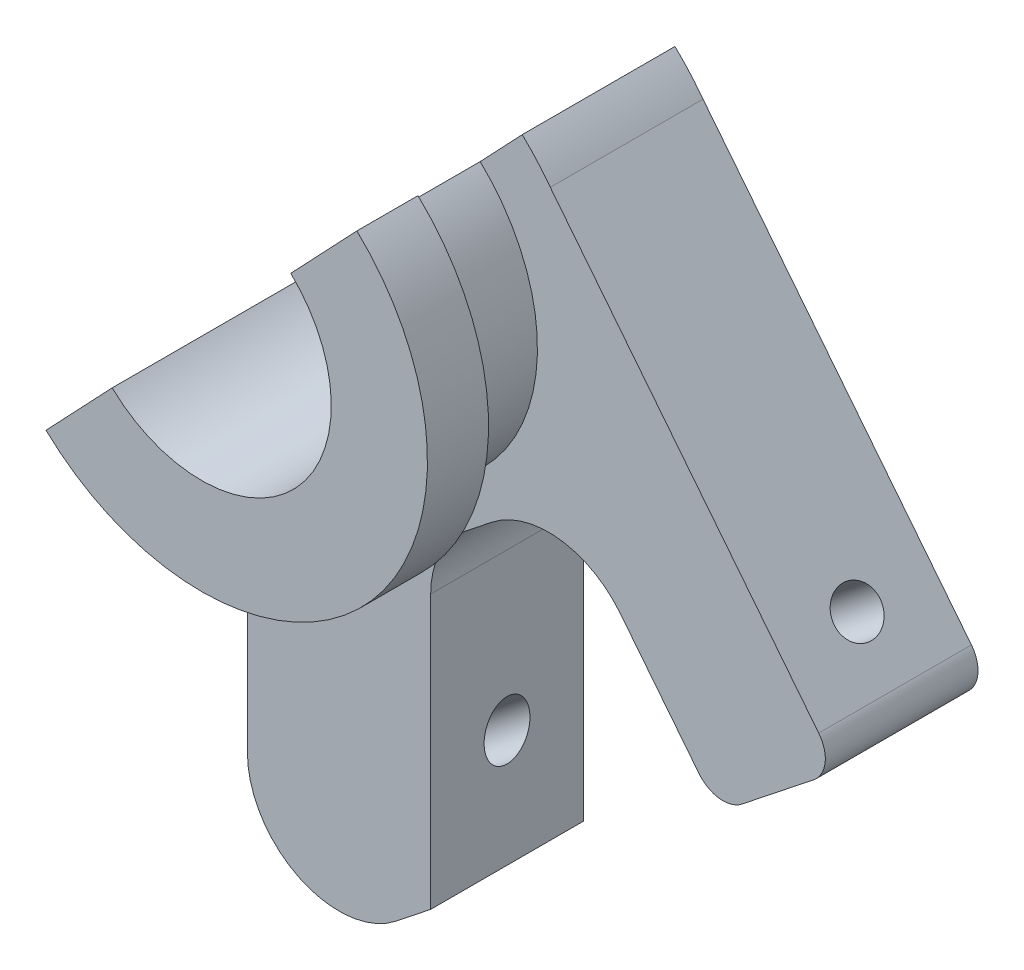
ISO-10303-21;
HEADER;
FILE_DESCRIPTION(('STEP AP214'),'2;1');
FILE_NAME('part.step','',(''),(''),'','','');
FILE_SCHEMA(('AUTOMOTIVE_DESIGN { 1 0 10303 214 1 1 1 1 }'));
ENDSEC;
DATA;
#1=APPLICATION_CONTEXT('core data for automotive mechanical design processes');
#2=APPLICATION_PROTOCOL_DEFINITION('international standard','automotive_design',2000,#1);
#3=PRODUCT_CONTEXT('',#1,'mechanical');
#4=PRODUCT('Part','Part','',(#3));
#5=PRODUCT_RELATED_PRODUCT_CATEGORY('part','',(#4));
#6=PRODUCT_DEFINITION_FORMATION('','',#4);
#7=PRODUCT_DEFINITION_CONTEXT('part definition',#1,'design');
#8=PRODUCT_DEFINITION('design','',#6,#7);
#9=PRODUCT_DEFINITION_SHAPE('','',#8);
#10=(LENGTH_UNIT() NAMED_UNIT(*) SI_UNIT(.MILLI.,.METRE.));
#11=(NAMED_UNIT(*) PLANE_ANGLE_UNIT() SI_UNIT($,.RADIAN.));
#12=(NAMED_UNIT(*) SI_UNIT($,.STERADIAN.) SOLID_ANGLE_UNIT());
#13=UNCERTAINTY_MEASURE_WITH_UNIT(LENGTH_MEASURE(1.E-05),#10,'distance_accuracy_value','');
#14=(GEOMETRIC_REPRESENTATION_CONTEXT(3) GLOBAL_UNCERTAINTY_ASSIGNED_CONTEXT((#13)) GLOBAL_UNIT_ASSIGNED_CONTEXT((#10,
#11,#12)) REPRESENTATION_CONTEXT('',''));
#15=CARTESIAN_POINT('',(0.,0.,0.));
#16=DIRECTION('',(0.,0.,1.));
#17=DIRECTION('',(1.,0.,0.));
#18=AXIS2_PLACEMENT_3D('',#15,#16,#17);
#19=CARTESIAN_POINT('',(9.56432153161784,-12.0602154080419,5.));
#20=DIRECTION('',(-0.621367715122971,0.783519088856716,0.));
#21=DIRECTION('',(-0.783519088856716,-0.621367715122971,0.));
#22=AXIS2_PLACEMENT_3D('',#19,#20,#21);
#23=PLANE('',#22);
#24=DIRECTION('',(0.,0.,1.));
#25=VECTOR('',#24,1.);
#26=CARTESIAN_POINT('',(1.36853143114638,-18.5598647985735,-17.));
#27=LINE('',#26,#25);
#28=CARTESIAN_POINT('',(1.36853143114638,-18.5598647985735,0.));
#29=VERTEX_POINT('',#28);
#30=CARTESIAN_POINT('',(1.36853143114638,-18.5598647985735,5.));
#31=VERTEX_POINT('',#30);
#32=EDGE_CURVE('E195',#29,#31,#27,.T.);
#33=ORIENTED_EDGE('',*,*,#32,.F.);
#34=DIRECTION('',(0.783519088856716,0.621367715122971,0.));
#35=VECTOR('',#34,1.);
#36=CARTESIAN_POINT('',(9.56432153161784,-12.0602154080419,0.));
#37=LINE('',#36,#35);
#38=CARTESIAN_POINT('',(2.50442828577747,-17.6590448399847,0.));
#39=VERTEX_POINT('',#38);
#40=EDGE_CURVE('E255',#29,#39,#37,.T.);
#41=ORIENTED_EDGE('',*,*,#40,.T.);
#42=DIRECTION('',(0.,0.,-1.));
#43=VECTOR('',#42,1.);
#44=CARTESIAN_POINT('',(2.50442828577747,-17.6590448399847,5.));
#45=LINE('',#44,#43);
#46=CARTESIAN_POINT('',(2.50442828577747,-17.6590448399847,5.));
#47=VERTEX_POINT('',#46);
#48=EDGE_CURVE('E280',#47,#39,#45,.T.);
#49=ORIENTED_EDGE('',*,*,#48,.F.);
#50=DIRECTION('',(0.783519088856716,0.621367715122971,0.));
#51=VECTOR('',#50,1.);
#52=CARTESIAN_POINT('',(9.56432153161784,-12.0602154080419,5.));
#53=LINE('',#52,#51);
#54=EDGE_CURVE('E223',#31,#47,#53,.T.);
#55=ORIENTED_EDGE('',*,*,#54,.F.);
#56=EDGE_LOOP('',(#33,#41,#49,#55));
#57=FACE_BOUND('',#56,.T.);
#58=ADVANCED_FACE('F47',(#57),#23,.F.);
#59=CARTESIAN_POINT('',(0.,0.,5.));
#60=DIRECTION('',(0.,0.,1.));
#61=DIRECTION('',(1.,0.,0.));
#62=AXIS2_PLACEMENT_3D('',#59,#60,#61);
#63=PLANE('',#62);
#64=CARTESIAN_POINT('',(12.6953065918597,-9.57719609091795,5.));
#65=VERTEX_POINT('',#64);
#66=CARTESIAN_POINT('',(15.0458638584298,-7.71309294554904,5.));
#67=VERTEX_POINT('',#66);
#68=EDGE_CURVE('E234',#65,#67,#53,.T.);
#69=ORIENTED_EDGE('',*,*,#68,.T.);
#70=CARTESIAN_POINT('',(14.4244961433068,-6.92957385669232,5.));
#71=DIRECTION('',(0.,0.,1.));
#72=DIRECTION('',(1.,0.,0.));
#73=AXIS2_PLACEMENT_3D('',#70,#71,#72);
#74=CIRCLE('',#73,1.);
#75=CARTESIAN_POINT('',(15.2080152321636,-6.30820614156935,5.));
#76=VERTEX_POINT('',#75);
#77=EDGE_CURVE('E56',#67,#76,#74,.T.);
#78=ORIENTED_EDGE('',*,*,#77,.T.);
#79=DIRECTION('',(-0.621367715122971,0.783519088856716,0.));
#80=VECTOR('',#79,1.);
#81=CARTESIAN_POINT('',(6.2650614156687,4.96849017761589,5.));
#82=LINE('',#81,#80);
#83=CARTESIAN_POINT('',(6.42116057758665,4.77165556561317,5.));
#84=VERTEX_POINT('',#83);
#85=EDGE_CURVE('E245',#76,#84,#82,.T.);
#86=ORIENTED_EDGE('',*,*,#85,.T.);
#87=CARTESIAN_POINT('',(0.,0.,5.));
#88=DIRECTION('',(0.,0.,1.));
#89=DIRECTION('',(1.,0.,0.));
#90=AXIS2_PLACEMENT_3D('',#87,#88,#89);
#91=CIRCLE('',#90,8.);
#92=CARTESIAN_POINT('',(5.50251468024793,5.80709326545183,5.));
#93=VERTEX_POINT('',#92);
#94=EDGE_CURVE('E248',#84,#93,#91,.T.);
#95=ORIENTED_EDGE('',*,*,#94,.T.);
#96=DIRECTION('',(0.687814335030992,0.725886658181479,0.));
#97=VECTOR('',#96,1.);
#98=CARTESIAN_POINT('',(0.,0.,5.));
#99=LINE('',#98,#97);
#100=CARTESIAN_POINT('',(4.12688601018595,4.35531994908887,5.));
#101=VERTEX_POINT('',#100);
#102=EDGE_CURVE('E389',#101,#93,#99,.T.);
#103=ORIENTED_EDGE('',*,*,#102,.F.);
#104=CARTESIAN_POINT('',(0.,0.,5.));
#105=DIRECTION('',(0.,0.,1.));
#106=DIRECTION('',(1.,0.,0.));
#107=AXIS2_PLACEMENT_3D('',#104,#105,#106);
#108=CIRCLE('',#107,6.);
#109=CARTESIAN_POINT('',(-3.49557171422254,-4.87657445249504,5.));
#110=VERTEX_POINT('',#109);
#111=EDGE_CURVE('E216',#110,#101,#108,.T.);
#112=ORIENTED_EDGE('',*,*,#111,.F.);
#113=DIRECTION('',(0.,-1.,0.));
#114=VECTOR('',#113,1.);
#115=CARTESIAN_POINT('',(-3.49557171422254,0.,5.));
#116=LINE('',#115,#114);
#117=CARTESIAN_POINT('',(-3.49557171422253,-16.2093075320034,5.));
#118=VERTEX_POINT('',#117);
#119=EDGE_CURVE('E206',#110,#118,#116,.T.);
#120=ORIENTED_EDGE('',*,*,#119,.T.);
#121=CARTESIAN_POINT('',(-0.495571714222533,-16.2093075320034,5.));
#122=DIRECTION('',(0.,0.,1.));
#123=DIRECTION('',(1.,0.,0.));
#124=AXIS2_PLACEMENT_3D('',#121,#122,#123);
#125=CIRCLE('',#124,3.);
#126=EDGE_CURVE('E189',#118,#31,#125,.T.);
#127=ORIENTED_EDGE('',*,*,#126,.T.);
#128=ORIENTED_EDGE('',*,*,#54,.T.);
#129=DIRECTION('',(0.,1.,0.));
#130=VECTOR('',#129,1.);
#131=CARTESIAN_POINT('',(2.50442828577747,0.,5.));
#132=LINE('',#131,#130);
#133=CARTESIAN_POINT('',(2.50442828577747,-8.71673207473975,5.));
#134=VERTEX_POINT('',#133);
#135=EDGE_CURVE('E233',#47,#134,#132,.T.);
#136=ORIENTED_EDGE('',*,*,#135,.T.);
#137=CARTESIAN_POINT('',(5.50442828577747,-8.71673207473975,5.));
#138=DIRECTION('',(0.,0.,1.));
#139=DIRECTION('',(1.,0.,0.));
#140=AXIS2_PLACEMENT_3D('',#137,#138,#139);
#141=CIRCLE('',#140,3.);
#142=CARTESIAN_POINT('',(3.64032514040855,-6.36617480816961,5.));
#143=VERTEX_POINT('',#142);
#144=EDGE_CURVE('E633',#134,#143,#141,.F.);
#145=ORIENTED_EDGE('',*,*,#144,.T.);
#146=DIRECTION('',(0.783519088856716,0.621367715122971,0.));
#147=VECTOR('',#146,1.);
#148=CARTESIAN_POINT('',(4.50491593464154,-5.68051339421119,5.));
#149=LINE('',#148,#147);
#150=CARTESIAN_POINT('',(4.50182463945651,-5.68296493757907,5.));
#151=VERTEX_POINT('',#150);
#152=EDGE_CURVE('E238',#143,#151,#149,.T.);
#153=ORIENTED_EDGE('',*,*,#152,.T.);
#154=CARTESIAN_POINT('',(6.36592778482542,-8.03352220414922,5.));
#155=DIRECTION('',(0.,0.,1.));
#156=DIRECTION('',(1.,0.,0.));
#157=AXIS2_PLACEMENT_3D('',#154,#155,#156);
#158=CIRCLE('',#157,3.);
#159=CARTESIAN_POINT('',(8.71648505139557,-6.16941905878031,5.));
#160=VERTEX_POINT('',#159);
#161=EDGE_CURVE('E375',#151,#160,#158,.F.);
#162=ORIENTED_EDGE('',*,*,#161,.T.);
#163=DIRECTION('',(0.62136771512297,-0.783519088856717,0.));
#164=VECTOR('',#163,1.);
#165=CARTESIAN_POINT('',(2.34746597138513,1.86165160200104,5.));
#166=LINE('',#165,#164);
#167=CARTESIAN_POINT('',(11.29041978788,-9.4150447171842,5.));
#168=VERTEX_POINT('',#167);
#169=EDGE_CURVE('E242',#160,#168,#166,.T.);
#170=ORIENTED_EDGE('',*,*,#169,.T.);
#171=CARTESIAN_POINT('',(12.0739388767367,-8.79367700206124,5.));
#172=DIRECTION('',(0.,0.,1.));
#173=DIRECTION('',(1.,0.,0.));
#174=AXIS2_PLACEMENT_3D('',#171,#172,#173);
#175=CIRCLE('',#174,1.);
#176=EDGE_CURVE('E359',#168,#65,#175,.T.);
#177=ORIENTED_EDGE('',*,*,#176,.T.);
#178=EDGE_LOOP('',(#69,#78,#86,#95,#103,#112,#120,#127,#128,#136,#145,#153,#162,#170,#177));
#179=FACE_BOUND('',#178,.T.);
#180=ADVANCED_FACE('F213',(#179),#63,.T.);
#181=CARTESIAN_POINT('',(0.,0.,0.));
#182=DIRECTION('',(0.,0.,1.));
#183=DIRECTION('',(1.,0.,0.));
#184=AXIS2_PLACEMENT_3D('',#181,#182,#183);
#185=PLANE('',#184);
#186=DIRECTION('',(-0.621367715122971,0.783519088856716,0.));
#187=VECTOR('',#186,1.);
#188=CARTESIAN_POINT('',(6.2650614156687,4.96849017761589,0.));
#189=LINE('',#188,#187);
#190=CARTESIAN_POINT('',(15.2080152321636,-6.30820614156935,0.));
#191=VERTEX_POINT('',#190);
#192=CARTESIAN_POINT('',(6.42116057758665,4.77165556561317,0.));
#193=VERTEX_POINT('',#192);
#194=EDGE_CURVE('E271',#191,#193,#189,.T.);
#195=ORIENTED_EDGE('',*,*,#194,.F.);
#196=CARTESIAN_POINT('',(14.4244961433068,-6.92957385669232,0.));
#197=DIRECTION('',(0.,0.,1.));
#198=DIRECTION('',(1.,0.,0.));
#199=AXIS2_PLACEMENT_3D('',#196,#197,#198);
#200=CIRCLE('',#199,1.);
#201=CARTESIAN_POINT('',(15.0458638584298,-7.71309294554904,0.));
#202=VERTEX_POINT('',#201);
#203=EDGE_CURVE('E356',#191,#202,#200,.F.);
#204=ORIENTED_EDGE('',*,*,#203,.T.);
#205=CARTESIAN_POINT('',(12.6953065918597,-9.57719609091795,0.));
#206=VERTEX_POINT('',#205);
#207=EDGE_CURVE('E260',#206,#202,#37,.T.);
#208=ORIENTED_EDGE('',*,*,#207,.F.);
#209=CARTESIAN_POINT('',(12.0739388767367,-8.79367700206124,0.));
#210=DIRECTION('',(0.,0.,1.));
#211=DIRECTION('',(1.,0.,0.));
#212=AXIS2_PLACEMENT_3D('',#209,#210,#211);
#213=CIRCLE('',#212,1.);
#214=CARTESIAN_POINT('',(11.29041978788,-9.4150447171842,0.));
#215=VERTEX_POINT('',#214);
#216=EDGE_CURVE('E374',#206,#215,#213,.F.);
#217=ORIENTED_EDGE('',*,*,#216,.T.);
#218=DIRECTION('',(0.62136771512297,-0.783519088856717,0.));
#219=VECTOR('',#218,1.);
#220=CARTESIAN_POINT('',(2.34746597138513,1.86165160200104,0.));
#221=LINE('',#220,#219);
#222=CARTESIAN_POINT('',(8.71648505139557,-6.16941905878031,0.));
#223=VERTEX_POINT('',#222);
#224=EDGE_CURVE('E268',#223,#215,#221,.T.);
#225=ORIENTED_EDGE('',*,*,#224,.F.);
#226=CARTESIAN_POINT('',(6.36592778482542,-8.03352220414922,0.));
#227=DIRECTION('',(0.,0.,1.));
#228=DIRECTION('',(1.,0.,0.));
#229=AXIS2_PLACEMENT_3D('',#226,#227,#228);
#230=CIRCLE('',#229,3.);
#231=CARTESIAN_POINT('',(4.50182463945651,-5.68296493757907,0.));
#232=VERTEX_POINT('',#231);
#233=EDGE_CURVE('E380',#223,#232,#230,.T.);
#234=ORIENTED_EDGE('',*,*,#233,.T.);
#235=DIRECTION('',(0.783519088856716,0.621367715122971,0.));
#236=VECTOR('',#235,1.);
#237=CARTESIAN_POINT('',(4.50491593464154,-5.68051339421119,0.));
#238=LINE('',#237,#236);
#239=CARTESIAN_POINT('',(3.64032514040855,-6.36617480816961,0.));
#240=VERTEX_POINT('',#239);
#241=EDGE_CURVE('E264',#240,#232,#238,.T.);
#242=ORIENTED_EDGE('',*,*,#241,.F.);
#243=CARTESIAN_POINT('',(5.50442828577747,-8.71673207473975,0.));
#244=DIRECTION('',(0.,0.,1.));
#245=DIRECTION('',(1.,0.,0.));
#246=AXIS2_PLACEMENT_3D('',#243,#244,#245);
#247=CIRCLE('',#246,3.);
#248=CARTESIAN_POINT('',(2.50442828577747,-8.71673207473975,0.));
#249=VERTEX_POINT('',#248);
#250=EDGE_CURVE('E628',#240,#249,#247,.T.);
#251=ORIENTED_EDGE('',*,*,#250,.T.);
#252=DIRECTION('',(0.,1.,0.));
#253=VECTOR('',#252,1.);
#254=CARTESIAN_POINT('',(2.50442828577747,0.,0.));
#255=LINE('',#254,#253);
#256=EDGE_CURVE('E259',#39,#249,#255,.T.);
#257=ORIENTED_EDGE('',*,*,#256,.F.);
#258=ORIENTED_EDGE('',*,*,#40,.F.);
#259=CARTESIAN_POINT('',(-0.495571714222533,-16.2093075320034,0.));
#260=DIRECTION('',(0.,0.,1.));
#261=DIRECTION('',(1.,0.,0.));
#262=AXIS2_PLACEMENT_3D('',#259,#260,#261);
#263=CIRCLE('',#262,3.);
#264=CARTESIAN_POINT('',(-3.49557171422253,-16.2093075320034,0.));
#265=VERTEX_POINT('',#264);
#266=EDGE_CURVE('E302',#265,#29,#263,.T.);
#267=ORIENTED_EDGE('',*,*,#266,.F.);
#268=DIRECTION('',(0.,-1.,0.));
#269=VECTOR('',#268,1.);
#270=CARTESIAN_POINT('',(-3.49557171422254,0.,0.));
#271=LINE('',#270,#269);
#272=CARTESIAN_POINT('',(-3.49557171422254,-3.68906075497302,0.));
#273=VERTEX_POINT('',#272);
#274=EDGE_CURVE('E209',#273,#265,#271,.T.);
#275=ORIENTED_EDGE('',*,*,#274,.F.);
#276=DIRECTION('',(0.687814335030992,0.725886658181479,0.));
#277=VECTOR('',#276,1.);
#278=CARTESIAN_POINT('',(0.,0.,0.));
#279=LINE('',#278,#277);
#280=CARTESIAN_POINT('',(-2.92321092388172,-3.08501829727128,0.));
#281=VERTEX_POINT('',#280);
#282=EDGE_CURVE('E425',#273,#281,#279,.T.);
#283=ORIENTED_EDGE('',*,*,#282,.T.);
#284=CARTESIAN_POINT('',(0.,0.,0.));
#285=DIRECTION('',(0.,0.,1.));
#286=DIRECTION('',(1.,0.,0.));
#287=AXIS2_PLACEMENT_3D('',#284,#285,#286);
#288=CIRCLE('',#287,4.25);
#289=CARTESIAN_POINT('',(2.92321092388171,3.08501829727129,0.));
#290=VERTEX_POINT('',#289);
#291=EDGE_CURVE('E219',#281,#290,#288,.T.);
#292=ORIENTED_EDGE('',*,*,#291,.T.);
#293=CARTESIAN_POINT('',(5.50251468024793,5.80709326545183,0.));
#294=VERTEX_POINT('',#293);
#295=EDGE_CURVE('E440',#290,#294,#279,.T.);
#296=ORIENTED_EDGE('',*,*,#295,.T.);
#297=CARTESIAN_POINT('',(0.,0.,0.));
#298=DIRECTION('',(0.,0.,1.));
#299=DIRECTION('',(1.,0.,0.));
#300=AXIS2_PLACEMENT_3D('',#297,#298,#299);
#301=CIRCLE('',#300,8.);
#302=EDGE_CURVE('E225',#193,#294,#301,.T.);
#303=ORIENTED_EDGE('',*,*,#302,.F.);
#304=EDGE_LOOP('',(#195,#204,#208,#217,#225,#234,#242,#251,#257,#258,#267,#275,#283,#292,#296,#303));
#305=FACE_BOUND('',#304,.T.);
#306=ADVANCED_FACE('F331',(#305),#185,.F.);
#307=CARTESIAN_POINT('',(-3.27214015293013,-18.4112576965613,2.5));
#308=DIRECTION('',(0.783519088856716,0.621367715122971,0.));
#309=DIRECTION('',(-0.621367715122971,0.783519088856716,0.));
#310=AXIS2_PLACEMENT_3D('',#307,#308,#309);
#311=CYLINDRICAL_SURFACE('',#310,0.750000000000001);
#312=CARTESIAN_POINT('',(2.50442828577747,-13.830165566121,2.5));
#313=DIRECTION('',(-1.,0.,0.));
#314=DIRECTION('',(0.,1.,0.));
#315=AXIS2_PLACEMENT_3D('',#312,#313,#314);
#316=ELLIPSE('',#315,0.95721981846591,0.750000000000001);
#317=CARTESIAN_POINT('',(2.50442828577747,-12.8729457476551,2.5));
#318=VERTEX_POINT('',#317);
#319=EDGE_CURVE('E455',#318,#318,#316,.T.);
#320=ORIENTED_EDGE('',*,*,#319,.F.);
#321=EDGE_LOOP('',(#320));
#322=FACE_BOUND('',#321,.T.);
#323=CARTESIAN_POINT('',(-3.23751478749802,-17.4265783247675,2.5));
#324=CARTESIAN_POINT('',(-3.237514676094,-17.4265797378768,2.54141522526759));
#325=CARTESIAN_POINT('',(-3.2360775314301,-17.429831674764,2.58284346957352));
#326=CARTESIAN_POINT('',(-3.2303161821381,-17.4426852474565,2.66451027342446));
#327=CARTESIAN_POINT('',(-3.22599029724954,-17.4522905787372,2.70474812633497));
#328=CARTESIAN_POINT('',(-3.21442687573413,-17.4773831586244,2.78284106146588));
#329=CARTESIAN_POINT('',(-3.20719309735771,-17.4928628136354,2.82069914661832));
#330=CARTESIAN_POINT('',(-3.18977226097577,-17.5290365726179,2.89309325575936));
#331=CARTESIAN_POINT('',(-3.1795850775856,-17.5497308979695,2.92762913862336));
#332=CARTESIAN_POINT('',(-3.15598938811252,-17.5959809884086,2.99315849357938));
#333=CARTESIAN_POINT('',(-3.14252097523027,-17.6216250668095,3.02406808010521));
#334=CARTESIAN_POINT('',(-3.11247821412046,-17.6765424847334,3.08072841830791));
#335=CARTESIAN_POINT('',(-3.09590357579974,-17.7058161631415,3.10647868768647));
#336=CARTESIAN_POINT('',(-3.05948695615394,-17.7673941347249,3.15243264028944));
#337=CARTESIAN_POINT('',(-3.03960261140391,-17.7997350157085,3.17255391644845));
#338=CARTESIAN_POINT('',(-2.99698286871107,-17.865957889117,3.20614289324591));
#339=CARTESIAN_POINT('',(-2.97424789204308,-17.8998396533551,3.21961157557465));
#340=CARTESIAN_POINT('',(-2.92685772118447,-17.9672927845899,3.23924435037358));
#341=CARTESIAN_POINT('',(-2.90225075749436,-18.0008565347669,3.24555089329798));
#342=CARTESIAN_POINT('',(-2.85135014773914,-18.067278878835,3.25112751378267));
#343=CARTESIAN_POINT('',(-2.82505675161594,-18.1001375762611,3.25039863166288));
#344=CARTESIAN_POINT('',(-2.77217498192739,-18.1634679064605,3.24202754492496));
#345=CARTESIAN_POINT('',(-2.74560609997254,-18.1939763282562,3.23453910248384));
#346=CARTESIAN_POINT('',(-2.69247283563422,-18.2526363270415,3.21310861898545));
#347=CARTESIAN_POINT('',(-2.66590845356557,-18.2807877784759,3.19916623438678));
#348=CARTESIAN_POINT('',(-2.61345936297497,-18.3343891802991,3.16509922879388));
#349=CARTESIAN_POINT('',(-2.58758296433925,-18.3598124230585,3.14491988660148));
#350=CARTESIAN_POINT('',(-2.53770087421153,-18.4072371949508,3.09899329626512));
#351=CARTESIAN_POINT('',(-2.51369550916984,-18.4292381276368,3.07324507943182));
#352=CARTESIAN_POINT('',(-2.46786297032497,-18.4700675605303,3.01608737740529));
#353=CARTESIAN_POINT('',(-2.44611233241719,-18.4887940842642,2.98454353229567));
#354=CARTESIAN_POINT('',(-2.40649866668964,-18.5221045295058,2.91712000793793));
#355=CARTESIAN_POINT('',(-2.38863582057862,-18.536688257396,2.8812401261527));
#356=CARTESIAN_POINT('',(-2.35757253504086,-18.5616156232399,2.80591298975531));
#357=CARTESIAN_POINT('',(-2.34439512315323,-18.571938358525,2.76644928090604));
#358=CARTESIAN_POINT('',(-2.32352660359052,-18.5881217752548,2.68522435957707));
#359=CARTESIAN_POINT('',(-2.31583432189416,-18.5939834115582,2.64346364080506));
#360=CARTESIAN_POINT('',(-2.30649804500839,-18.6010808463593,2.56001214954306));
#361=CARTESIAN_POINT('',(-2.30469966763076,-18.6024347341578,2.51834866200111));
#362=CARTESIAN_POINT('',(-2.30681792447683,-18.6008319287857,2.43525341902655));
#363=CARTESIAN_POINT('',(-2.31073403261323,-18.5978756324197,2.39382164261463));
#364=CARTESIAN_POINT('',(-2.32395037446418,-18.5877730169918,2.31306572051359));
#365=CARTESIAN_POINT('',(-2.33316146726873,-18.5806960445403,2.27371818202875));
#366=CARTESIAN_POINT('',(-2.3564245984363,-18.5624848260441,2.19747056264449));
#367=CARTESIAN_POINT('',(-2.37047721024731,-18.5513500993744,2.1605707722834));
#368=CARTESIAN_POINT('',(-2.40307784976955,-18.5248783396734,2.0894676166398));
#369=CARTESIAN_POINT('',(-2.42170865702897,-18.5094631541797,2.05533134798707));
#370=CARTESIAN_POINT('',(-2.46248550367628,-18.4746919650586,1.99144349115959));
#371=CARTESIAN_POINT('',(-2.48463212066919,-18.455335313748,1.96169262500498));
#372=CARTESIAN_POINT('',(-2.53212403315661,-18.4123743448384,1.90665668722871));
#373=CARTESIAN_POINT('',(-2.55753549839223,-18.3886758638282,1.88150198123536));
#374=CARTESIAN_POINT('',(-2.61007797952201,-18.3377342192673,1.83731923991463));
#375=CARTESIAN_POINT('',(-2.6372089056353,-18.310491240713,1.81829088501754));
#376=CARTESIAN_POINT('',(-2.69194880522604,-18.2531970666162,1.78706618964162));
#377=CARTESIAN_POINT('',(-2.71955280644841,-18.223167957314,1.77482071468628));
#378=CARTESIAN_POINT('',(-2.77443080212387,-18.1608512869957,1.75736189961747));
#379=CARTESIAN_POINT('',(-2.80170485925731,-18.1285641631019,1.75214720237828));
#380=CARTESIAN_POINT('',(-2.85429113751737,-18.0635309638234,1.74897430781835));
#381=CARTESIAN_POINT('',(-2.87963646420273,-18.0308209022244,1.75082371817846));
#382=CARTESIAN_POINT('',(-2.92845253142515,-17.9650885867419,1.76128587047075));
#383=CARTESIAN_POINT('',(-2.95192332768999,-17.932066342172,1.76989841125983));
#384=CARTESIAN_POINT('',(-2.99634490245949,-17.8669205547787,1.79353916482819));
#385=CARTESIAN_POINT('',(-3.01730856698342,-17.8347931309108,1.80853258998597));
#386=CARTESIAN_POINT('',(-3.05653162134996,-17.7722688352425,1.84447793426449));
#387=CARTESIAN_POINT('',(-3.07479066985508,-17.7418721821724,1.86543060450218));
#388=CARTESIAN_POINT('',(-3.10883068172879,-17.6830984373801,1.9132864254978));
#389=CARTESIAN_POINT('',(-3.12454179751493,-17.6547871746362,1.94032010718052));
#390=CARTESIAN_POINT('',(-3.1528811307047,-17.6020049541978,1.99931713898035));
#391=CARTESIAN_POINT('',(-3.16550856555736,-17.577534971873,2.03128173707346));
#392=CARTESIAN_POINT('',(-3.18789422695924,-17.5329520774952,2.09995106065097));
#393=CARTESIAN_POINT('',(-3.19759453084378,-17.5129289672891,2.13673309255936));
#394=CARTESIAN_POINT('',(-3.21384040546365,-17.4787076620709,2.21354161744213));
#395=CARTESIAN_POINT('',(-3.22038827186936,-17.4645052294451,2.25356572458046));
#396=CARTESIAN_POINT('',(-3.22943568475603,-17.4446544765374,2.32793275886971));
#397=CARTESIAN_POINT('',(-3.23246644315581,-17.4378968031431,2.36191987328677));
#398=CARTESIAN_POINT('',(-3.2365059549617,-17.4288583261456,2.4306016517511));
#399=CARTESIAN_POINT('',(-3.23751488084863,-17.4265771406575,2.46529625518797));
#400=CARTESIAN_POINT('',(-3.23751478749802,-17.4265783247675,2.5));
#401=B_SPLINE_CURVE_WITH_KNOTS('',3,(#323,#324,#325,#326,#327,#328,#329,#330,#331,#332,#333,
#334,#335,#336,#337,#338,#339,#340,#341,#342,#343,#344,#345,#346,#347,#348,#349,#350,#351,#352,
#353,#354,#355,#356,#357,#358,#359,#360,#361,#362,#363,#364,#365,#366,#367,#368,#369,#370,#371,
#372,#373,#374,#375,#376,#377,#378,#379,#380,#381,#382,#383,#384,#385,#386,#387,#388,#389,#390,
#391,#392,#393,#394,#395,#396,#397,#398,#399,#400),.UNSPECIFIED.,.T.,.F.,(4,2,2,2,2,2,2,2,2,2,2,
2,2,2,2,2,2,2,2,2,2,2,2,2,2,2,2,2,2,2,2,2,2,2,2,2,2,2,4),(0.,0.124118232506422,
0.248308722400658,0.372339218121863,0.496374980238492,0.622871862550987,0.749380564411658,
0.877654489165819,1.00590947951334,1.1315662529581,1.25720444597012,1.3800547880389,
1.50291167014642,1.62687862273539,1.7508671563788,1.87821139968779,2.00556159357146,
2.13352929599727,2.2614696003607,2.38603072425721,2.51058038152347,2.63309221499968,
2.75561856423631,2.88054853754953,3.0054990566272,3.13357599286802,3.26164624713072,
3.38877621839285,3.51588164669918,3.63955033835443,3.763215352103,3.88621462965119,
4.00922941718628,4.13519128971827,4.26118509466859,4.38952943182609,4.51778016407192,
4.62179348150405,4.72579792527063),.UNSPECIFIED.);
#402=CARTESIAN_POINT('',(-3.23751478749802,-17.4265783247675,2.5));
#403=VERTEX_POINT('',#402);
#404=EDGE_CURVE('E293',#403,#403,#401,.T.);
#405=ORIENTED_EDGE('',*,*,#404,.F.);
#406=EDGE_LOOP('',(#405));
#407=FACE_BOUND('',#406,.T.);
#408=ADVANCED_FACE('F304',(#322,#407),#311,.F.);
#409=CARTESIAN_POINT('',(-3.49557171422254,0.,5.));
#410=DIRECTION('',(1.,0.,0.));
#411=DIRECTION('',(0.,1.,0.));
#412=AXIS2_PLACEMENT_3D('',#409,#410,#411);
#413=PLANE('',#412);
#414=ORIENTED_EDGE('',*,*,#274,.T.);
#415=DIRECTION('',(0.,0.,1.));
#416=VECTOR('',#415,1.);
#417=CARTESIAN_POINT('',(-3.49557171422253,-16.2093075320034,-17.));
#418=LINE('',#417,#416);
#419=EDGE_CURVE('E192',#265,#118,#418,.T.);
#420=ORIENTED_EDGE('',*,*,#419,.T.);
#421=ORIENTED_EDGE('',*,*,#119,.F.);
#422=CARTESIAN_POINT('',(-3.49557171422254,-3.68906075497302,5.));
#423=VERTEX_POINT('',#422);
#424=EDGE_CURVE('E218',#423,#110,#116,.T.);
#425=ORIENTED_EDGE('',*,*,#424,.F.);
#426=DIRECTION('',(0.,0.,-1.));
#427=VECTOR('',#426,1.);
#428=CARTESIAN_POINT('',(-3.49557171422254,-3.68906075497302,5.));
#429=LINE('',#428,#427);
#430=EDGE_CURVE('E426',#423,#273,#429,.T.);
#431=ORIENTED_EDGE('',*,*,#430,.T.);
#432=EDGE_LOOP('',(#414,#420,#421,#425,#431));
#433=FACE_BOUND('',#432,.T.);
#434=ADVANCED_FACE('F204',(#433),#413,.F.);
#435=CARTESIAN_POINT('',(2.50442828577747,0.,5.));
#436=DIRECTION('',(-1.,0.,0.));
#437=DIRECTION('',(0.,-1.,0.));
#438=AXIS2_PLACEMENT_3D('',#435,#436,#437);
#439=PLANE('',#438);
#440=ORIENTED_EDGE('',*,*,#319,.T.);
#441=EDGE_LOOP('',(#440));
#442=FACE_BOUND('',#441,.T.);
#443=ORIENTED_EDGE('',*,*,#256,.T.);
#444=DIRECTION('',(0.,0.,-1.));
#445=VECTOR('',#444,1.);
#446=CARTESIAN_POINT('',(2.50442828577747,-8.71673207473975,5.));
#447=LINE('',#446,#445);
#448=EDGE_CURVE('E629',#249,#134,#447,.F.);
#449=ORIENTED_EDGE('',*,*,#448,.T.);
#450=ORIENTED_EDGE('',*,*,#135,.F.);
#451=ORIENTED_EDGE('',*,*,#48,.T.);
#452=EDGE_LOOP('',(#443,#449,#450,#451));
#453=FACE_BOUND('',#452,.T.);
#454=ADVANCED_FACE('F652',(#442,#453),#439,.F.);
#455=CARTESIAN_POINT('',(4.50491593464154,-5.68051339421119,5.));
#456=DIRECTION('',(-0.621367715122971,0.783519088856716,0.));
#457=DIRECTION('',(-0.783519088856716,-0.621367715122971,0.));
#458=AXIS2_PLACEMENT_3D('',#455,#456,#457);
#459=PLANE('',#458);
#460=ORIENTED_EDGE('',*,*,#152,.F.);
#461=DIRECTION('',(0.,0.,-1.));
#462=VECTOR('',#461,1.);
#463=CARTESIAN_POINT('',(3.64032514040855,-6.36617480816961,0.));
#464=LINE('',#463,#462);
#465=EDGE_CURVE('E635',#143,#240,#464,.T.);
#466=ORIENTED_EDGE('',*,*,#465,.T.);
#467=ORIENTED_EDGE('',*,*,#241,.T.);
#468=DIRECTION('',(0.,0.,-1.));
#469=VECTOR('',#468,1.);
#470=CARTESIAN_POINT('',(4.50182463945651,-5.68296493757907,5.));
#471=LINE('',#470,#469);
#472=EDGE_CURVE('E292',#232,#151,#471,.F.);
#473=ORIENTED_EDGE('',*,*,#472,.T.);
#474=EDGE_LOOP('',(#460,#466,#467,#473));
#475=FACE_BOUND('',#474,.T.);
#476=ADVANCED_FACE('F344',(#475),#459,.F.);
#477=CARTESIAN_POINT('',(2.34746597138513,1.86165160200104,5.));
#478=DIRECTION('',(0.783519088856717,0.62136771512297,0.));
#479=DIRECTION('',(-0.62136771512297,0.783519088856717,0.));
#480=AXIS2_PLACEMENT_3D('',#477,#478,#479);
#481=PLANE('',#480);
#482=CARTESIAN_POINT('',(10.047684357634,-7.84800653947077,2.5));
#483=DIRECTION('',(0.783519088856717,0.62136771512297,0.));
#484=DIRECTION('',(-0.62136771512297,0.783519088856717,0.));
#485=AXIS2_PLACEMENT_3D('',#482,#483,#484);
#486=CIRCLE('',#485,0.750000000000001);
#487=CARTESIAN_POINT('',(9.58165857129181,-7.26036722282823,2.5));
#488=VERTEX_POINT('',#487);
#489=EDGE_CURVE('E459',#488,#488,#486,.T.);
#490=ORIENTED_EDGE('',*,*,#489,.T.);
#491=EDGE_LOOP('',(#490));
#492=FACE_BOUND('',#491,.T.);
#493=ORIENTED_EDGE('',*,*,#224,.T.);
#494=DIRECTION('',(0.,0.,-1.));
#495=VECTOR('',#494,1.);
#496=CARTESIAN_POINT('',(11.29041978788,-9.4150447171842,5.));
#497=LINE('',#496,#495);
#498=EDGE_CURVE('E11',#215,#168,#497,.F.);
#499=ORIENTED_EDGE('',*,*,#498,.T.);
#500=ORIENTED_EDGE('',*,*,#169,.F.);
#501=DIRECTION('',(0.,0.,-1.));
#502=VECTOR('',#501,1.);
#503=CARTESIAN_POINT('',(8.71648505139557,-6.1694190587803,0.));
#504=LINE('',#503,#502);
#505=EDGE_CURVE('E624',#160,#223,#504,.T.);
#506=ORIENTED_EDGE('',*,*,#505,.T.);
#507=EDGE_LOOP('',(#493,#499,#500,#506));
#508=FACE_BOUND('',#507,.T.);
#509=ADVANCED_FACE('F337',(#492,#508),#481,.F.);
#510=ORIENTED_EDGE('',*,*,#207,.T.);
#511=DIRECTION('',(0.,0.,-1.));
#512=VECTOR('',#511,1.);
#513=CARTESIAN_POINT('',(15.0458638584298,-7.71309294554904,5.));
#514=LINE('',#513,#512);
#515=EDGE_CURVE('E69',#202,#67,#514,.F.);
#516=ORIENTED_EDGE('',*,*,#515,.T.);
#517=ORIENTED_EDGE('',*,*,#68,.F.);
#518=DIRECTION('',(0.,0.,-1.));
#519=VECTOR('',#518,1.);
#520=CARTESIAN_POINT('',(12.6953065918597,-9.57719609091795,5.));
#521=LINE('',#520,#519);
#522=EDGE_CURVE('E349',#65,#206,#521,.T.);
#523=ORIENTED_EDGE('',*,*,#522,.T.);
#524=EDGE_LOOP('',(#510,#516,#517,#523));
#525=FACE_BOUND('',#524,.T.);
#526=ADVANCED_FACE('F326',(#525),#23,.F.);
#527=CARTESIAN_POINT('',(6.2650614156687,4.96849017761589,5.));
#528=DIRECTION('',(-0.783519088856717,-0.621367715122971,0.));
#529=DIRECTION('',(0.621367715122971,-0.783519088856717,0.));
#530=AXIS2_PLACEMENT_3D('',#527,#528,#529);
#531=PLANE('',#530);
#532=CARTESIAN_POINT('',(13.9652798019176,-4.74116796385591,2.5));
#533=DIRECTION('',(0.783519088856716,0.621367715122971,0.));
#534=DIRECTION('',(-0.621367715122971,0.783519088856716,0.));
#535=AXIS2_PLACEMENT_3D('',#532,#533,#534);
#536=CIRCLE('',#535,0.750000000000001);
#537=CARTESIAN_POINT('',(13.4992540155754,-4.15352864721338,2.5));
#538=VERTEX_POINT('',#537);
#539=EDGE_CURVE('E463',#538,#538,#536,.T.);
#540=ORIENTED_EDGE('',*,*,#539,.F.);
#541=EDGE_LOOP('',(#540));
#542=FACE_BOUND('',#541,.T.);
#543=ORIENTED_EDGE('',*,*,#85,.F.);
#544=DIRECTION('',(0.,0.,-1.));
#545=VECTOR('',#544,1.);
#546=CARTESIAN_POINT('',(15.2080152321636,-6.30820614156935,5.));
#547=LINE('',#546,#545);
#548=EDGE_CURVE('E370',#76,#191,#547,.T.);
#549=ORIENTED_EDGE('',*,*,#548,.T.);
#550=ORIENTED_EDGE('',*,*,#194,.T.);
#551=DIRECTION('',(0.,0.,-1.));
#552=VECTOR('',#551,1.);
#553=CARTESIAN_POINT('',(6.42116057758665,4.77165556561317,5.));
#554=LINE('',#553,#552);
#555=EDGE_CURVE('E252',#84,#193,#554,.T.);
#556=ORIENTED_EDGE('',*,*,#555,.F.);
#557=EDGE_LOOP('',(#543,#549,#550,#556));
#558=FACE_BOUND('',#557,.T.);
#559=ADVANCED_FACE('F336',(#542,#558),#531,.F.);
#560=CARTESIAN_POINT('',(0.,0.,5.));
#561=DIRECTION('',(0.,0.,-1.));
#562=DIRECTION('',(-1.,0.,0.));
#563=AXIS2_PLACEMENT_3D('',#560,#561,#562);
#564=CYLINDRICAL_SURFACE('',#563,8.);
#565=ORIENTED_EDGE('',*,*,#302,.T.);
#566=DIRECTION('',(0.,0.,-1.));
#567=VECTOR('',#566,1.);
#568=CARTESIAN_POINT('',(5.50251468024793,5.80709326545183,5.));
#569=LINE('',#568,#567);
#570=EDGE_CURVE('E388',#294,#93,#569,.F.);
#571=ORIENTED_EDGE('',*,*,#570,.T.);
#572=ORIENTED_EDGE('',*,*,#94,.F.);
#573=ORIENTED_EDGE('',*,*,#555,.T.);
#574=EDGE_LOOP('',(#565,#571,#572,#573));
#575=FACE_BOUND('',#574,.T.);
#576=ADVANCED_FACE('F342',(#575),#564,.T.);
#577=CARTESIAN_POINT('',(0.,0.,5.));
#578=DIRECTION('',(0.,0.,-1.));
#579=DIRECTION('',(-1.,0.,0.));
#580=AXIS2_PLACEMENT_3D('',#577,#578,#579);
#581=CYLINDRICAL_SURFACE('',#580,4.25);
#582=DIRECTION('',(0.,0.,-1.));
#583=VECTOR('',#582,1.);
#584=CARTESIAN_POINT('',(-2.92321092388172,-3.08501829727128,5.));
#585=LINE('',#584,#583);
#586=CARTESIAN_POINT('',(-2.92321092388172,-3.08501829727129,10.));
#587=VERTEX_POINT('',#586);
#588=EDGE_CURVE('E422',#587,#281,#585,.T.);
#589=ORIENTED_EDGE('',*,*,#588,.F.);
#590=CARTESIAN_POINT('',(0.,0.,10.));
#591=DIRECTION('',(0.,0.,1.));
#592=DIRECTION('',(1.,0.,0.));
#593=AXIS2_PLACEMENT_3D('',#590,#591,#592);
#594=CIRCLE('',#593,4.25);
#595=CARTESIAN_POINT('',(2.92321092388171,3.08501829727129,10.));
#596=VERTEX_POINT('',#595);
#597=EDGE_CURVE('E416',#587,#596,#594,.T.);
#598=ORIENTED_EDGE('',*,*,#597,.T.);
#599=DIRECTION('',(0.,0.,-1.));
#600=VECTOR('',#599,1.);
#601=CARTESIAN_POINT('',(2.92321092388171,3.08501829727129,5.));
#602=LINE('',#601,#600);
#603=EDGE_CURVE('E437',#290,#596,#602,.F.);
#604=ORIENTED_EDGE('',*,*,#603,.F.);
#605=ORIENTED_EDGE('',*,*,#291,.F.);
#606=EDGE_LOOP('',(#589,#598,#604,#605));
#607=FACE_BOUND('',#606,.T.);
#608=ADVANCED_FACE('F480',(#607),#581,.F.);
#609=CARTESIAN_POINT('',(0.,0.,5.));
#610=DIRECTION('',(0.,0.,1.));
#611=DIRECTION('',(1.,0.,0.));
#612=AXIS2_PLACEMENT_3D('',#609,#610,#611);
#613=PLANE('',#612);
#614=CARTESIAN_POINT('',(-4.12688601018595,-4.35531994908887,5.));
#615=VERTEX_POINT('',#614);
#616=EDGE_CURVE('E229',#615,#110,#108,.T.);
#617=ORIENTED_EDGE('',*,*,#616,.F.);
#618=DIRECTION('',(0.687814335030992,0.725886658181479,0.));
#619=VECTOR('',#618,1.);
#620=CARTESIAN_POINT('',(0.,0.,5.));
#621=LINE('',#620,#619);
#622=EDGE_CURVE('E429',#615,#423,#621,.T.);
#623=ORIENTED_EDGE('',*,*,#622,.T.);
#624=ORIENTED_EDGE('',*,*,#424,.T.);
#625=EDGE_LOOP('',(#617,#623,#624));
#626=FACE_BOUND('',#625,.T.);
#627=ADVANCED_FACE('F490',(#626),#613,.F.);
#628=CARTESIAN_POINT('',(0.,0.,8.));
#629=DIRECTION('',(0.,0.,-1.));
#630=DIRECTION('',(-1.,0.,0.));
#631=AXIS2_PLACEMENT_3D('',#628,#629,#630);
#632=CYLINDRICAL_SURFACE('',#631,6.);
#633=CARTESIAN_POINT('',(0.,0.,8.));
#634=DIRECTION('',(0.,0.,1.));
#635=DIRECTION('',(1.,0.,0.));
#636=AXIS2_PLACEMENT_3D('',#633,#634,#635);
#637=CIRCLE('',#636,6.);
#638=CARTESIAN_POINT('',(-4.12688601018595,-4.35531994908887,8.));
#639=VERTEX_POINT('',#638);
#640=CARTESIAN_POINT('',(4.12688601018595,4.35531994908887,8.));
#641=VERTEX_POINT('',#640);
#642=EDGE_CURVE('E256',#639,#641,#637,.T.);
#643=ORIENTED_EDGE('',*,*,#642,.F.);
#644=DIRECTION('',(0.,0.,-1.));
#645=VECTOR('',#644,1.);
#646=CARTESIAN_POINT('',(-4.12688601018595,-4.35531994908887,8.));
#647=LINE('',#646,#645);
#648=EDGE_CURVE('E433',#639,#615,#647,.T.);
#649=ORIENTED_EDGE('',*,*,#648,.T.);
#650=ORIENTED_EDGE('',*,*,#616,.T.);
#651=ORIENTED_EDGE('',*,*,#111,.T.);
#652=DIRECTION('',(0.,0.,-1.));
#653=VECTOR('',#652,1.);
#654=CARTESIAN_POINT('',(4.12688601018595,4.35531994908887,8.));
#655=LINE('',#654,#653);
#656=EDGE_CURVE('E392',#101,#641,#655,.F.);
#657=ORIENTED_EDGE('',*,*,#656,.T.);
#658=EDGE_LOOP('',(#643,#649,#650,#651,#657));
#659=FACE_BOUND('',#658,.T.);
#660=ADVANCED_FACE('F398',(#659),#632,.T.);
#661=CARTESIAN_POINT('',(0.,0.,10.));
#662=DIRECTION('',(0.,0.,1.));
#663=DIRECTION('',(1.,0.,0.));
#664=AXIS2_PLACEMENT_3D('',#661,#662,#663);
#665=PLANE('',#664);
#666=DIRECTION('',(0.687814335030992,0.725886658181479,0.));
#667=VECTOR('',#666,1.);
#668=CARTESIAN_POINT('',(7.92268755370664,8.36122903998066,10.));
#669=LINE('',#668,#667);
#670=CARTESIAN_POINT('',(-5.0891945953883,-5.37089483241899,10.));
#671=VERTEX_POINT('',#670);
#672=EDGE_CURVE('E451',#671,#587,#669,.T.);
#673=ORIENTED_EDGE('',*,*,#672,.F.);
#674=CARTESIAN_POINT('',(0.,0.,10.));
#675=DIRECTION('',(0.,0.,1.));
#676=DIRECTION('',(1.,0.,0.));
#677=AXIS2_PLACEMENT_3D('',#674,#675,#676);
#678=CIRCLE('',#677,7.39908189781911);
#679=CARTESIAN_POINT('',(5.0891945953883,5.37089483241899,10.));
#680=VERTEX_POINT('',#679);
#681=EDGE_CURVE('E404',#671,#680,#678,.T.);
#682=ORIENTED_EDGE('',*,*,#681,.T.);
#683=EDGE_CURVE('E452',#596,#680,#669,.T.);
#684=ORIENTED_EDGE('',*,*,#683,.F.);
#685=ORIENTED_EDGE('',*,*,#597,.F.);
#686=EDGE_LOOP('',(#673,#682,#684,#685));
#687=FACE_BOUND('',#686,.T.);
#688=ADVANCED_FACE('F483',(#687),#665,.T.);
#689=CARTESIAN_POINT('',(0.,0.,8.));
#690=DIRECTION('',(0.,0.,1.));
#691=DIRECTION('',(1.,0.,0.));
#692=AXIS2_PLACEMENT_3D('',#689,#690,#691);
#693=PLANE('',#692);
#694=CARTESIAN_POINT('',(0.,0.,8.));
#695=DIRECTION('',(0.,0.,1.));
#696=DIRECTION('',(1.,0.,0.));
#697=AXIS2_PLACEMENT_3D('',#694,#695,#696);
#698=CIRCLE('',#697,7.39908189781911);
#699=CARTESIAN_POINT('',(-5.0891945953883,-5.37089483241899,8.));
#700=VERTEX_POINT('',#699);
#701=CARTESIAN_POINT('',(5.0891945953883,5.37089483241899,8.));
#702=VERTEX_POINT('',#701);
#703=EDGE_CURVE('E408',#700,#702,#698,.T.);
#704=ORIENTED_EDGE('',*,*,#703,.F.);
#705=DIRECTION('',(0.687814335030992,0.725886658181479,0.));
#706=VECTOR('',#705,1.);
#707=CARTESIAN_POINT('',(0.,0.,8.));
#708=LINE('',#707,#706);
#709=EDGE_CURVE('E436',#700,#639,#708,.T.);
#710=ORIENTED_EDGE('',*,*,#709,.T.);
#711=ORIENTED_EDGE('',*,*,#642,.T.);
#712=EDGE_CURVE('E447',#641,#702,#708,.T.);
#713=ORIENTED_EDGE('',*,*,#712,.T.);
#714=EDGE_LOOP('',(#704,#710,#711,#713));
#715=FACE_BOUND('',#714,.T.);
#716=ADVANCED_FACE('F488',(#715),#693,.F.);
#717=CARTESIAN_POINT('',(0.,0.,10.));
#718=DIRECTION('',(0.,0.,-1.));
#719=DIRECTION('',(-1.,0.,0.));
#720=AXIS2_PLACEMENT_3D('',#717,#718,#719);
#721=CYLINDRICAL_SURFACE('',#720,7.39908189781911);
#722=ORIENTED_EDGE('',*,*,#681,.F.);
#723=DIRECTION('',(0.,0.,-1.));
#724=VECTOR('',#723,1.);
#725=CARTESIAN_POINT('',(-5.0891945953883,-5.37089483241899,10.));
#726=LINE('',#725,#724);
#727=EDGE_CURVE('E288',#671,#700,#726,.T.);
#728=ORIENTED_EDGE('',*,*,#727,.T.);
#729=ORIENTED_EDGE('',*,*,#703,.T.);
#730=DIRECTION('',(0.,0.,-1.));
#731=VECTOR('',#730,1.);
#732=CARTESIAN_POINT('',(5.0891945953883,5.37089483241899,10.));
#733=LINE('',#732,#731);
#734=EDGE_CURVE('E284',#702,#680,#733,.F.);
#735=ORIENTED_EDGE('',*,*,#734,.T.);
#736=EDGE_LOOP('',(#722,#728,#729,#735));
#737=FACE_BOUND('',#736,.T.);
#738=ADVANCED_FACE('F485',(#737),#721,.T.);
#739=CARTESIAN_POINT('',(7.92268755370664,8.36122903998066,-2.));
#740=DIRECTION('',(0.725886658181479,-0.687814335030992,0.));
#741=DIRECTION('',(0.687814335030992,0.725886658181479,0.));
#742=AXIS2_PLACEMENT_3D('',#739,#740,#741);
#743=PLANE('',#742);
#744=ORIENTED_EDGE('',*,*,#603,.T.);
#745=ORIENTED_EDGE('',*,*,#683,.T.);
#746=ORIENTED_EDGE('',*,*,#734,.F.);
#747=ORIENTED_EDGE('',*,*,#712,.F.);
#748=ORIENTED_EDGE('',*,*,#656,.F.);
#749=ORIENTED_EDGE('',*,*,#102,.T.);
#750=ORIENTED_EDGE('',*,*,#570,.F.);
#751=ORIENTED_EDGE('',*,*,#295,.F.);
#752=EDGE_LOOP('',(#744,#745,#746,#747,#748,#749,#750,#751));
#753=FACE_BOUND('',#752,.T.);
#754=ADVANCED_FACE('F482',(#753),#743,.F.);
#755=ORIENTED_EDGE('',*,*,#588,.T.);
#756=ORIENTED_EDGE('',*,*,#282,.F.);
#757=ORIENTED_EDGE('',*,*,#430,.F.);
#758=ORIENTED_EDGE('',*,*,#622,.F.);
#759=ORIENTED_EDGE('',*,*,#648,.F.);
#760=ORIENTED_EDGE('',*,*,#709,.F.);
#761=ORIENTED_EDGE('',*,*,#727,.F.);
#762=ORIENTED_EDGE('',*,*,#672,.T.);
#763=EDGE_LOOP('',(#755,#756,#757,#758,#759,#760,#761,#762));
#764=FACE_BOUND('',#763,.T.);
#765=ADVANCED_FACE('F321',(#764),#743,.F.);
#766=ORIENTED_EDGE('',*,*,#539,.T.);
#767=EDGE_LOOP('',(#766));
#768=FACE_BOUND('',#767,.T.);
#769=ORIENTED_EDGE('',*,*,#489,.F.);
#770=EDGE_LOOP('',(#769));
#771=FACE_BOUND('',#770,.T.);
#772=ADVANCED_FACE('F310',(#768,#771),#311,.F.);
#773=CARTESIAN_POINT('',(-0.495571714222533,-16.2093075320034,-17.));
#774=DIRECTION('',(0.,0.,1.));
#775=DIRECTION('',(1.,0.,0.));
#776=AXIS2_PLACEMENT_3D('',#773,#774,#775);
#777=CYLINDRICAL_SURFACE('',#776,3.);
#778=ORIENTED_EDGE('',*,*,#404,.T.);
#779=EDGE_LOOP('',(#778));
#780=FACE_BOUND('',#779,.T.);
#781=ORIENTED_EDGE('',*,*,#266,.T.);
#782=ORIENTED_EDGE('',*,*,#32,.T.);
#783=ORIENTED_EDGE('',*,*,#126,.F.);
#784=ORIENTED_EDGE('',*,*,#419,.F.);
#785=EDGE_LOOP('',(#781,#782,#783,#784));
#786=FACE_BOUND('',#785,.T.);
#787=ADVANCED_FACE('F191',(#780,#786),#777,.T.);
#788=CARTESIAN_POINT('',(5.50442828577747,-8.71673207473975,5.));
#789=DIRECTION('',(0.,0.,1.));
#790=DIRECTION('',(1.,0.,0.));
#791=AXIS2_PLACEMENT_3D('',#788,#789,#790);
#792=CYLINDRICAL_SURFACE('',#791,3.);
#793=ORIENTED_EDGE('',*,*,#144,.F.);
#794=ORIENTED_EDGE('',*,*,#448,.F.);
#795=ORIENTED_EDGE('',*,*,#250,.F.);
#796=ORIENTED_EDGE('',*,*,#465,.F.);
#797=EDGE_LOOP('',(#793,#794,#795,#796));
#798=FACE_BOUND('',#797,.T.);
#799=ADVANCED_FACE('F309',(#798),#792,.F.);
#800=CARTESIAN_POINT('',(6.36592778482542,-8.03352220414922,5.));
#801=DIRECTION('',(0.,0.,1.));
#802=DIRECTION('',(1.,0.,0.));
#803=AXIS2_PLACEMENT_3D('',#800,#801,#802);
#804=CYLINDRICAL_SURFACE('',#803,3.);
#805=ORIENTED_EDGE('',*,*,#161,.F.);
#806=ORIENTED_EDGE('',*,*,#472,.F.);
#807=ORIENTED_EDGE('',*,*,#233,.F.);
#808=ORIENTED_EDGE('',*,*,#505,.F.);
#809=EDGE_LOOP('',(#805,#806,#807,#808));
#810=FACE_BOUND('',#809,.T.);
#811=ADVANCED_FACE('F317',(#810),#804,.F.);
#812=CARTESIAN_POINT('',(14.4244961433068,-6.92957385669232,5.));
#813=DIRECTION('',(0.,0.,-1.));
#814=DIRECTION('',(-1.,0.,0.));
#815=AXIS2_PLACEMENT_3D('',#812,#813,#814);
#816=CYLINDRICAL_SURFACE('',#815,1.);
#817=ORIENTED_EDGE('',*,*,#77,.F.);
#818=ORIENTED_EDGE('',*,*,#515,.F.);
#819=ORIENTED_EDGE('',*,*,#203,.F.);
#820=ORIENTED_EDGE('',*,*,#548,.F.);
#821=EDGE_LOOP('',(#817,#818,#819,#820));
#822=FACE_BOUND('',#821,.T.);
#823=ADVANCED_FACE('F354',(#822),#816,.T.);
#824=CARTESIAN_POINT('',(12.0739388767367,-8.79367700206124,5.));
#825=DIRECTION('',(0.,0.,-1.));
#826=DIRECTION('',(-1.,0.,0.));
#827=AXIS2_PLACEMENT_3D('',#824,#825,#826);
#828=CYLINDRICAL_SURFACE('',#827,1.);
#829=ORIENTED_EDGE('',*,*,#176,.F.);
#830=ORIENTED_EDGE('',*,*,#498,.F.);
#831=ORIENTED_EDGE('',*,*,#216,.F.);
#832=ORIENTED_EDGE('',*,*,#522,.F.);
#833=EDGE_LOOP('',(#829,#830,#831,#832));
#834=FACE_BOUND('',#833,.T.);
#835=ADVANCED_FACE('F49',(#834),#828,.T.);
#836=CLOSED_SHELL('',(#58,#180,#306,#408,#434,#454,#476,#509,#526,#559,#576,#608,#627,#660,#688,
#716,#738,#754,#765,#772,#787,#799,#811,#823,#835));
#837=MANIFOLD_SOLID_BREP('B2',#836);
#838=ADVANCED_BREP_SHAPE_REPRESENTATION('',(#18,#837),#14);
#839=SHAPE_DEFINITION_REPRESENTATION(#9,#838);
ENDSEC;
END-ISO-10303-21;
